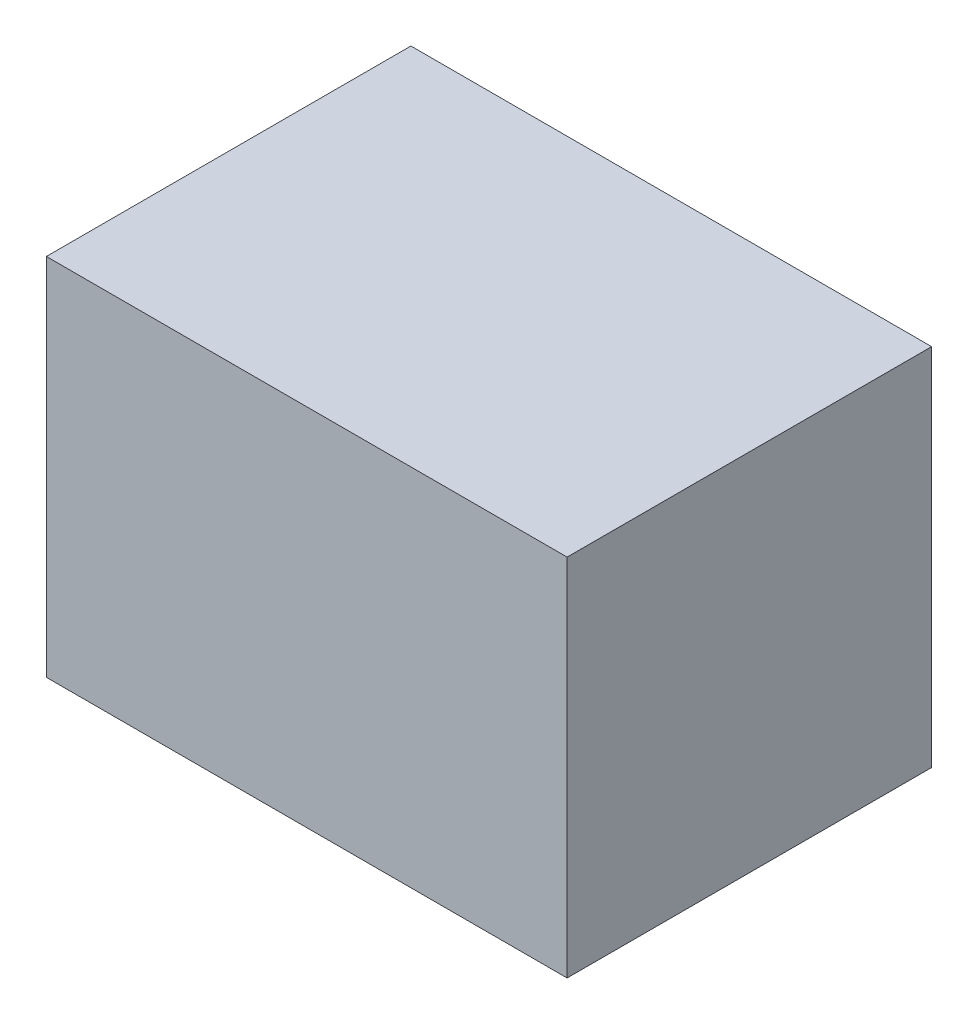
ISO-10303-21;
HEADER;
FILE_DESCRIPTION(('STEP AP214'),'2;1');
FILE_NAME('part.step','',(''),(''),'','','');
FILE_SCHEMA(('AUTOMOTIVE_DESIGN { 1 0 10303 214 1 1 1 1 }'));
ENDSEC;
DATA;
#1=APPLICATION_CONTEXT('core data for automotive mechanical design processes');
#2=APPLICATION_PROTOCOL_DEFINITION('international standard','automotive_design',2000,#1);
#3=PRODUCT_CONTEXT('',#1,'mechanical');
#4=PRODUCT('Part','Part','',(#3));
#5=PRODUCT_RELATED_PRODUCT_CATEGORY('part','',(#4));
#6=PRODUCT_DEFINITION_FORMATION('','',#4);
#7=PRODUCT_DEFINITION_CONTEXT('part definition',#1,'design');
#8=PRODUCT_DEFINITION('design','',#6,#7);
#9=PRODUCT_DEFINITION_SHAPE('','',#8);
#10=(LENGTH_UNIT() NAMED_UNIT(*) SI_UNIT(.MILLI.,.METRE.));
#11=(NAMED_UNIT(*) PLANE_ANGLE_UNIT() SI_UNIT($,.RADIAN.));
#12=(NAMED_UNIT(*) SI_UNIT($,.STERADIAN.) SOLID_ANGLE_UNIT());
#13=UNCERTAINTY_MEASURE_WITH_UNIT(LENGTH_MEASURE(1.E-05),#10,'distance_accuracy_value','');
#14=(GEOMETRIC_REPRESENTATION_CONTEXT(3) GLOBAL_UNCERTAINTY_ASSIGNED_CONTEXT((#13)) GLOBAL_UNIT_ASSIGNED_CONTEXT((#10,
#11,#12)) REPRESENTATION_CONTEXT('',''));
#15=CARTESIAN_POINT('',(0.,0.,0.));
#16=DIRECTION('',(0.,0.,1.));
#17=DIRECTION('',(1.,0.,0.));
#18=AXIS2_PLACEMENT_3D('',#15,#16,#17);
#19=CARTESIAN_POINT('',(-15.24,0.,0.));
#20=DIRECTION('',(0.,1.,0.));
#21=DIRECTION('',(1.,0.,0.));
#22=AXIS2_PLACEMENT_3D('',#19,#20,#21);
#23=PLANE('',#22);
#24=DIRECTION('',(0.,0.,1.));
#25=VECTOR('',#24,1.);
#26=CARTESIAN_POINT('',(-0.25,0.,0.749999999999982));
#27=LINE('',#26,#25);
#28=CARTESIAN_POINT('',(-0.25,0.,0.749999999999982));
#29=VERTEX_POINT('',#28);
#30=CARTESIAN_POINT('',(-0.25,0.,1.1));
#31=VERTEX_POINT('',#30);
#32=EDGE_CURVE('E82',#29,#31,#27,.T.);
#33=ORIENTED_EDGE('',*,*,#32,.T.);
#34=DIRECTION('',(1.,0.,0.));
#35=VECTOR('',#34,1.);
#36=CARTESIAN_POINT('',(-0.25,0.,1.1));
#37=LINE('',#36,#35);
#38=CARTESIAN_POINT('',(0.25,0.,1.1));
#39=VERTEX_POINT('',#38);
#40=EDGE_CURVE('E28',#31,#39,#37,.T.);
#41=ORIENTED_EDGE('',*,*,#40,.T.);
#42=DIRECTION('',(0.,0.,1.));
#43=VECTOR('',#42,1.);
#44=CARTESIAN_POINT('',(0.25,0.,0.749999999999982));
#45=LINE('',#44,#43);
#46=CARTESIAN_POINT('',(0.25,0.,0.749999999999982));
#47=VERTEX_POINT('',#46);
#48=EDGE_CURVE('E21',#47,#39,#45,.T.);
#49=ORIENTED_EDGE('',*,*,#48,.F.);
#50=DIRECTION('',(1.,0.,0.));
#51=VECTOR('',#50,1.);
#52=CARTESIAN_POINT('',(-0.25,0.,0.749999999999982));
#53=LINE('',#52,#51);
#54=EDGE_CURVE('E86',#29,#47,#53,.T.);
#55=ORIENTED_EDGE('',*,*,#54,.F.);
#56=EDGE_LOOP('',(#33,#41,#49,#55));
#57=FACE_BOUND('',#56,.T.);
#58=ADVANCED_FACE('F17',(#57),#23,.T.);
#59=CARTESIAN_POINT('',(-15.24,-0.35,0.));
#60=DIRECTION('',(0.,1.,0.));
#61=DIRECTION('',(1.,0.,0.));
#62=AXIS2_PLACEMENT_3D('',#59,#60,#61);
#63=PLANE('',#62);
#64=DIRECTION('',(0.,0.,1.));
#65=VECTOR('',#64,1.);
#66=CARTESIAN_POINT('',(-0.25,-0.35,0.749999999999982));
#67=LINE('',#66,#65);
#68=CARTESIAN_POINT('',(-0.25,-0.35,0.749999999999982));
#69=VERTEX_POINT('',#68);
#70=CARTESIAN_POINT('',(-0.25,-0.35,1.1));
#71=VERTEX_POINT('',#70);
#72=EDGE_CURVE('E84',#69,#71,#67,.T.);
#73=ORIENTED_EDGE('',*,*,#72,.F.);
#74=DIRECTION('',(1.,0.,0.));
#75=VECTOR('',#74,1.);
#76=CARTESIAN_POINT('',(-0.25,-0.35,0.749999999999982));
#77=LINE('',#76,#75);
#78=CARTESIAN_POINT('',(0.25,-0.35,0.749999999999982));
#79=VERTEX_POINT('',#78);
#80=EDGE_CURVE('E106',#69,#79,#77,.T.);
#81=ORIENTED_EDGE('',*,*,#80,.T.);
#82=DIRECTION('',(0.,0.,1.));
#83=VECTOR('',#82,1.);
#84=CARTESIAN_POINT('',(0.25,-0.35,0.749999999999982));
#85=LINE('',#84,#83);
#86=CARTESIAN_POINT('',(0.25,-0.35,1.1));
#87=VERTEX_POINT('',#86);
#88=EDGE_CURVE('E76',#79,#87,#85,.T.);
#89=ORIENTED_EDGE('',*,*,#88,.T.);
#90=DIRECTION('',(1.,0.,0.));
#91=VECTOR('',#90,1.);
#92=CARTESIAN_POINT('',(-0.25,-0.35,1.1));
#93=LINE('',#92,#91);
#94=EDGE_CURVE('E11',#71,#87,#93,.T.);
#95=ORIENTED_EDGE('',*,*,#94,.F.);
#96=EDGE_LOOP('',(#73,#81,#89,#95));
#97=FACE_BOUND('',#96,.T.);
#98=ADVANCED_FACE('F163',(#97),#63,.F.);
#99=CARTESIAN_POINT('',(-0.25,-0.35,1.1));
#100=DIRECTION('',(0.,0.,1.));
#101=DIRECTION('',(1.,0.,0.));
#102=AXIS2_PLACEMENT_3D('',#99,#100,#101);
#103=PLANE('',#102);
#104=ORIENTED_EDGE('',*,*,#40,.F.);
#105=DIRECTION('',(0.,1.,0.));
#106=VECTOR('',#105,1.);
#107=CARTESIAN_POINT('',(-0.25,-0.35,1.1));
#108=LINE('',#107,#106);
#109=EDGE_CURVE('E68',#71,#31,#108,.T.);
#110=ORIENTED_EDGE('',*,*,#109,.F.);
#111=ORIENTED_EDGE('',*,*,#94,.T.);
#112=DIRECTION('',(0.,1.,0.));
#113=VECTOR('',#112,1.);
#114=CARTESIAN_POINT('',(0.25,-0.35,1.1));
#115=LINE('',#114,#113);
#116=EDGE_CURVE('E71',#87,#39,#115,.T.);
#117=ORIENTED_EDGE('',*,*,#116,.T.);
#118=EDGE_LOOP('',(#104,#110,#111,#117));
#119=FACE_BOUND('',#118,.T.);
#120=ADVANCED_FACE('F19',(#119),#103,.T.);
#121=CARTESIAN_POINT('',(0.25,-0.35,0.749999999999982));
#122=DIRECTION('',(-1.,0.,0.));
#123=DIRECTION('',(0.,0.,1.));
#124=AXIS2_PLACEMENT_3D('',#121,#122,#123);
#125=PLANE('',#124);
#126=ORIENTED_EDGE('',*,*,#48,.T.);
#127=ORIENTED_EDGE('',*,*,#116,.F.);
#128=ORIENTED_EDGE('',*,*,#88,.F.);
#129=DIRECTION('',(0.,1.,0.));
#130=VECTOR('',#129,1.);
#131=CARTESIAN_POINT('',(0.25,-0.35,0.749999999999982));
#132=LINE('',#131,#130);
#133=EDGE_CURVE('E100',#79,#47,#132,.T.);
#134=ORIENTED_EDGE('',*,*,#133,.T.);
#135=EDGE_LOOP('',(#126,#127,#128,#134));
#136=FACE_BOUND('',#135,.T.);
#137=ADVANCED_FACE('F147',(#136),#125,.F.);
#138=CARTESIAN_POINT('',(-0.25,-0.35,0.749999999999982));
#139=DIRECTION('',(0.,0.,1.));
#140=DIRECTION('',(1.,0.,0.));
#141=AXIS2_PLACEMENT_3D('',#138,#139,#140);
#142=PLANE('',#141);
#143=ORIENTED_EDGE('',*,*,#54,.T.);
#144=ORIENTED_EDGE('',*,*,#133,.F.);
#145=ORIENTED_EDGE('',*,*,#80,.F.);
#146=DIRECTION('',(0.,1.,0.));
#147=VECTOR('',#146,1.);
#148=CARTESIAN_POINT('',(-0.25,-0.35,0.749999999999982));
#149=LINE('',#148,#147);
#150=EDGE_CURVE('E91',#69,#29,#149,.T.);
#151=ORIENTED_EDGE('',*,*,#150,.T.);
#152=EDGE_LOOP('',(#143,#144,#145,#151));
#153=FACE_BOUND('',#152,.T.);
#154=ADVANCED_FACE('F143',(#153),#142,.F.);
#155=CARTESIAN_POINT('',(-0.25,-0.35,0.749999999999982));
#156=DIRECTION('',(-1.,0.,0.));
#157=DIRECTION('',(0.,0.,1.));
#158=AXIS2_PLACEMENT_3D('',#155,#156,#157);
#159=PLANE('',#158);
#160=ORIENTED_EDGE('',*,*,#32,.F.);
#161=ORIENTED_EDGE('',*,*,#150,.F.);
#162=ORIENTED_EDGE('',*,*,#72,.T.);
#163=ORIENTED_EDGE('',*,*,#109,.T.);
#164=EDGE_LOOP('',(#160,#161,#162,#163));
#165=FACE_BOUND('',#164,.T.);
#166=ADVANCED_FACE('F80',(#165),#159,.T.);
#167=CLOSED_SHELL('',(#58,#98,#120,#137,#154,#166));
#168=MANIFOLD_SOLID_BREP('B1',#167);
#169=ADVANCED_BREP_SHAPE_REPRESENTATION('',(#18,#168),#14);
#170=SHAPE_DEFINITION_REPRESENTATION(#9,#169);
ENDSEC;
END-ISO-10303-21;
